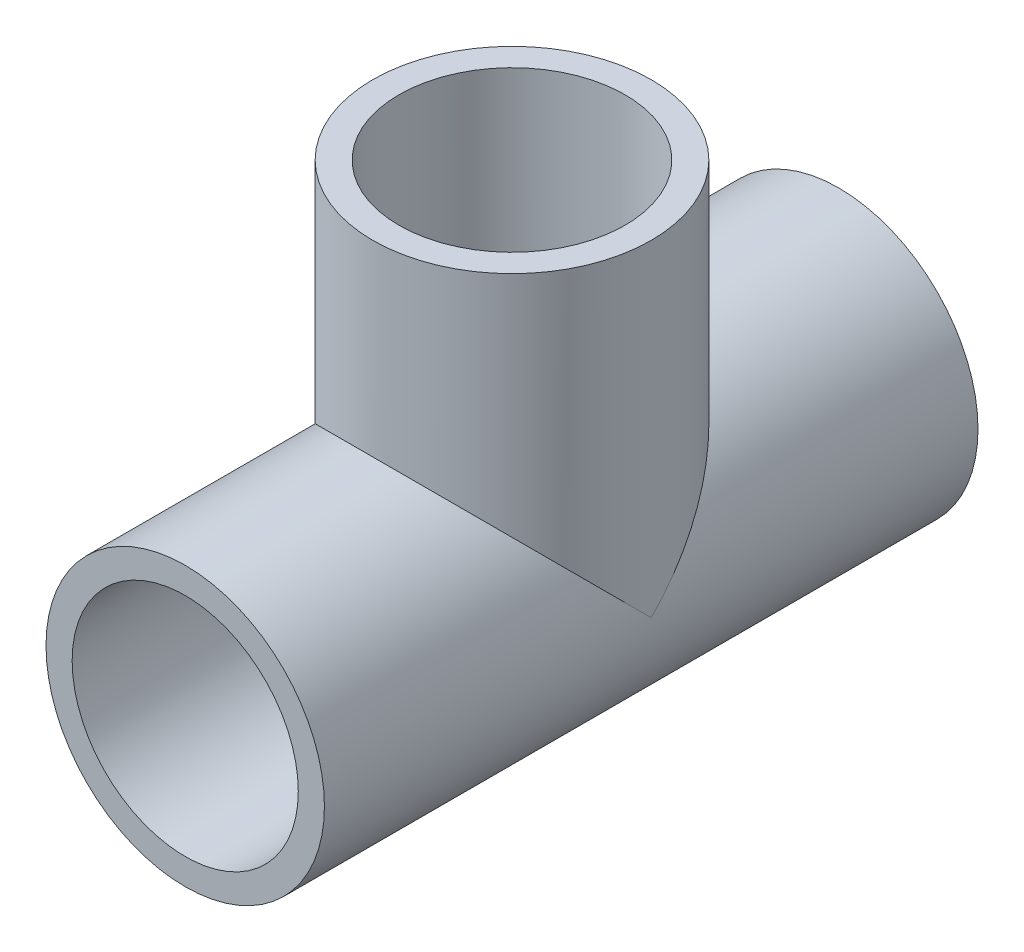
ISO-10303-21;
HEADER;
FILE_DESCRIPTION(('STEP AP214'),'2;1');
FILE_NAME('part.step','',(''),(''),'','','');
FILE_SCHEMA(('AUTOMOTIVE_DESIGN { 1 0 10303 214 1 1 1 1 }'));
ENDSEC;
DATA;
#1=APPLICATION_CONTEXT('core data for automotive mechanical design processes');
#2=APPLICATION_PROTOCOL_DEFINITION('international standard','automotive_design',2000,#1);
#3=PRODUCT_CONTEXT('',#1,'mechanical');
#4=PRODUCT('Part','Part','',(#3));
#5=PRODUCT_RELATED_PRODUCT_CATEGORY('part','',(#4));
#6=PRODUCT_DEFINITION_FORMATION('','',#4);
#7=PRODUCT_DEFINITION_CONTEXT('part definition',#1,'design');
#8=PRODUCT_DEFINITION('design','',#6,#7);
#9=PRODUCT_DEFINITION_SHAPE('','',#8);
#10=(LENGTH_UNIT() NAMED_UNIT(*) SI_UNIT(.MILLI.,.METRE.));
#11=(NAMED_UNIT(*) PLANE_ANGLE_UNIT() SI_UNIT($,.RADIAN.));
#12=(NAMED_UNIT(*) SI_UNIT($,.STERADIAN.) SOLID_ANGLE_UNIT());
#13=UNCERTAINTY_MEASURE_WITH_UNIT(LENGTH_MEASURE(1.E-05),#10,'distance_accuracy_value','');
#14=(GEOMETRIC_REPRESENTATION_CONTEXT(3) GLOBAL_UNCERTAINTY_ASSIGNED_CONTEXT((#13)) GLOBAL_UNIT_ASSIGNED_CONTEXT((#10,
#11,#12)) REPRESENTATION_CONTEXT('',''));
#15=CARTESIAN_POINT('',(0.,0.,0.));
#16=DIRECTION('',(0.,0.,1.));
#17=DIRECTION('',(1.,0.,0.));
#18=AXIS2_PLACEMENT_3D('',#15,#16,#17);
#19=CARTESIAN_POINT('',(0.,0.,-25.));
#20=DIRECTION('',(0.,0.,1.));
#21=DIRECTION('',(1.,0.,0.));
#22=AXIS2_PLACEMENT_3D('',#19,#20,#21);
#23=CYLINDRICAL_SURFACE('',#22,10.65);
#24=CARTESIAN_POINT('',(0.,0.,-25.));
#25=DIRECTION('',(0.,0.,1.));
#26=DIRECTION('',(1.,0.,0.));
#27=AXIS2_PLACEMENT_3D('',#24,#25,#26);
#28=CIRCLE('',#27,10.65);
#29=CARTESIAN_POINT('',(10.65,0.,-25.));
#30=VERTEX_POINT('',#29);
#31=EDGE_CURVE('E79',#30,#30,#28,.T.);
#32=ORIENTED_EDGE('',*,*,#31,.T.);
#33=EDGE_LOOP('',(#32));
#34=FACE_BOUND('',#33,.T.);
#35=CARTESIAN_POINT('',(0.,0.,25.));
#36=DIRECTION('',(0.,0.,1.));
#37=DIRECTION('',(1.,0.,0.));
#38=AXIS2_PLACEMENT_3D('',#35,#36,#37);
#39=CIRCLE('',#38,10.65);
#40=CARTESIAN_POINT('',(10.65,0.,25.));
#41=VERTEX_POINT('',#40);
#42=EDGE_CURVE('E66',#41,#41,#39,.T.);
#43=ORIENTED_EDGE('',*,*,#42,.F.);
#44=EDGE_LOOP('',(#43));
#45=FACE_BOUND('',#44,.T.);
#46=CARTESIAN_POINT('',(0.,0.,0.));
#47=DIRECTION('',(0.,0.707106781186547,0.707106781186547));
#48=DIRECTION('',(0.,-0.707106781186547,0.707106781186547));
#49=AXIS2_PLACEMENT_3D('',#46,#47,#48);
#50=ELLIPSE('',#49,15.0613744392735,10.65);
#51=CARTESIAN_POINT('',(-10.65,0.,0.));
#52=VERTEX_POINT('',#51);
#53=CARTESIAN_POINT('',(10.65,0.,0.));
#54=VERTEX_POINT('',#53);
#55=EDGE_CURVE('E40',#52,#54,#50,.F.);
#56=ORIENTED_EDGE('',*,*,#55,.T.);
#57=CARTESIAN_POINT('',(0.,0.,0.));
#58=DIRECTION('',(0.,-0.707106781186547,0.707106781186547));
#59=DIRECTION('',(0.,0.707106781186547,0.707106781186547));
#60=AXIS2_PLACEMENT_3D('',#57,#58,#59);
#61=ELLIPSE('',#60,15.0613744392735,10.65);
#62=EDGE_CURVE('E11',#54,#52,#61,.T.);
#63=ORIENTED_EDGE('',*,*,#62,.T.);
#64=EDGE_LOOP('',(#56,#63));
#65=FACE_BOUND('',#64,.T.);
#66=ADVANCED_FACE('F33',(#34,#45,#65),#23,.T.);
#67=CARTESIAN_POINT('',(0.,0.,-25.));
#68=DIRECTION('',(0.,0.,1.));
#69=DIRECTION('',(1.,0.,0.));
#70=AXIS2_PLACEMENT_3D('',#67,#68,#69);
#71=PLANE('',#70);
#72=CARTESIAN_POINT('',(0.,0.,-25.));
#73=DIRECTION('',(0.,0.,1.));
#74=DIRECTION('',(1.,0.,0.));
#75=AXIS2_PLACEMENT_3D('',#72,#73,#74);
#76=CIRCLE('',#75,8.65);
#77=CARTESIAN_POINT('',(8.65,0.,-25.));
#78=VERTEX_POINT('',#77);
#79=EDGE_CURVE('E59',#78,#78,#76,.T.);
#80=ORIENTED_EDGE('',*,*,#79,.T.);
#81=EDGE_LOOP('',(#80));
#82=FACE_BOUND('',#81,.T.);
#83=ORIENTED_EDGE('',*,*,#31,.F.);
#84=EDGE_LOOP('',(#83));
#85=FACE_BOUND('',#84,.T.);
#86=ADVANCED_FACE('F83',(#82,#85),#71,.F.);
#87=CARTESIAN_POINT('',(0.,0.,25.));
#88=DIRECTION('',(0.,0.,-1.));
#89=DIRECTION('',(1.,0.,0.));
#90=AXIS2_PLACEMENT_3D('',#87,#88,#89);
#91=PLANE('',#90);
#92=CARTESIAN_POINT('',(0.,0.,25.));
#93=DIRECTION('',(0.,0.,-1.));
#94=DIRECTION('',(-1.,0.,0.));
#95=AXIS2_PLACEMENT_3D('',#92,#93,#94);
#96=CIRCLE('',#95,8.65);
#97=CARTESIAN_POINT('',(-8.65,0.,25.));
#98=VERTEX_POINT('',#97);
#99=EDGE_CURVE('E71',#98,#98,#96,.F.);
#100=ORIENTED_EDGE('',*,*,#99,.F.);
#101=EDGE_LOOP('',(#100));
#102=FACE_BOUND('',#101,.T.);
#103=ORIENTED_EDGE('',*,*,#42,.T.);
#104=EDGE_LOOP('',(#103));
#105=FACE_BOUND('',#104,.T.);
#106=ADVANCED_FACE('F88',(#102,#105),#91,.F.);
#107=CARTESIAN_POINT('',(0.,25.,0.));
#108=DIRECTION('',(0.,-1.,0.));
#109=DIRECTION('',(0.,0.,-1.));
#110=AXIS2_PLACEMENT_3D('',#107,#108,#109);
#111=CYLINDRICAL_SURFACE('',#110,10.65);
#112=ORIENTED_EDGE('',*,*,#62,.F.);
#113=ORIENTED_EDGE('',*,*,#55,.F.);
#114=EDGE_LOOP('',(#112,#113));
#115=FACE_BOUND('',#114,.T.);
#116=CARTESIAN_POINT('',(0.,25.,0.));
#117=DIRECTION('',(0.,1.,0.));
#118=DIRECTION('',(0.,0.,1.));
#119=AXIS2_PLACEMENT_3D('',#116,#117,#118);
#120=CIRCLE('',#119,10.65);
#121=CARTESIAN_POINT('',(0.,25.,10.65));
#122=VERTEX_POINT('',#121);
#123=EDGE_CURVE('E63',#122,#122,#120,.T.);
#124=ORIENTED_EDGE('',*,*,#123,.F.);
#125=EDGE_LOOP('',(#124));
#126=FACE_BOUND('',#125,.T.);
#127=ADVANCED_FACE('F95',(#115,#126),#111,.T.);
#128=CARTESIAN_POINT('',(0.,25.,0.));
#129=DIRECTION('',(0.,1.,0.));
#130=DIRECTION('',(0.,0.,1.));
#131=AXIS2_PLACEMENT_3D('',#128,#129,#130);
#132=PLANE('',#131);
#133=CARTESIAN_POINT('',(0.,25.,0.));
#134=DIRECTION('',(0.,1.,0.));
#135=DIRECTION('',(0.,0.,1.));
#136=AXIS2_PLACEMENT_3D('',#133,#134,#135);
#137=CIRCLE('',#136,8.65);
#138=CARTESIAN_POINT('',(0.,25.,8.65));
#139=VERTEX_POINT('',#138);
#140=EDGE_CURVE('E74',#139,#139,#137,.T.);
#141=ORIENTED_EDGE('',*,*,#140,.F.);
#142=EDGE_LOOP('',(#141));
#143=FACE_BOUND('',#142,.T.);
#144=ORIENTED_EDGE('',*,*,#123,.T.);
#145=EDGE_LOOP('',(#144));
#146=FACE_BOUND('',#145,.T.);
#147=ADVANCED_FACE('F101',(#143,#146),#132,.T.);
#148=CARTESIAN_POINT('',(0.,0.,-25.));
#149=DIRECTION('',(0.,0.,1.));
#150=DIRECTION('',(1.,0.,0.));
#151=AXIS2_PLACEMENT_3D('',#148,#149,#150);
#152=CYLINDRICAL_SURFACE('',#151,8.65);
#153=ORIENTED_EDGE('',*,*,#79,.F.);
#154=EDGE_LOOP('',(#153));
#155=FACE_BOUND('',#154,.T.);
#156=ORIENTED_EDGE('',*,*,#99,.T.);
#157=EDGE_LOOP('',(#156));
#158=FACE_BOUND('',#157,.T.);
#159=CARTESIAN_POINT('',(0.,0.,0.));
#160=DIRECTION('',(0.,0.707106781186547,0.707106781186547));
#161=DIRECTION('',(0.,-0.707106781186547,0.707106781186547));
#162=AXIS2_PLACEMENT_3D('',#159,#160,#161);
#163=ELLIPSE('',#162,12.2329473145273,8.65);
#164=CARTESIAN_POINT('',(-8.65,0.,0.));
#165=VERTEX_POINT('',#164);
#166=CARTESIAN_POINT('',(8.65,0.,0.));
#167=VERTEX_POINT('',#166);
#168=EDGE_CURVE('E54',#165,#167,#163,.F.);
#169=ORIENTED_EDGE('',*,*,#168,.F.);
#170=CARTESIAN_POINT('',(0.,0.,0.));
#171=DIRECTION('',(0.,-0.707106781186547,0.707106781186547));
#172=DIRECTION('',(0.,0.707106781186547,0.707106781186547));
#173=AXIS2_PLACEMENT_3D('',#170,#171,#172);
#174=ELLIPSE('',#173,12.2329473145273,8.65);
#175=EDGE_CURVE('E57',#167,#165,#174,.T.);
#176=ORIENTED_EDGE('',*,*,#175,.F.);
#177=EDGE_LOOP('',(#169,#176));
#178=FACE_BOUND('',#177,.T.);
#179=ADVANCED_FACE('F56',(#155,#158,#178),#152,.F.);
#180=CARTESIAN_POINT('',(0.,25.,0.));
#181=DIRECTION('',(0.,-1.,0.));
#182=DIRECTION('',(0.,0.,-1.));
#183=AXIS2_PLACEMENT_3D('',#180,#181,#182);
#184=CYLINDRICAL_SURFACE('',#183,8.65);
#185=ORIENTED_EDGE('',*,*,#175,.T.);
#186=ORIENTED_EDGE('',*,*,#168,.T.);
#187=EDGE_LOOP('',(#185,#186));
#188=FACE_BOUND('',#187,.T.);
#189=ORIENTED_EDGE('',*,*,#140,.T.);
#190=EDGE_LOOP('',(#189));
#191=FACE_BOUND('',#190,.T.);
#192=ADVANCED_FACE('F61',(#188,#191),#184,.F.);
#193=CLOSED_SHELL('',(#66,#86,#106,#127,#147,#179,#192));
#194=MANIFOLD_SOLID_BREP('B2',#193);
#195=ADVANCED_BREP_SHAPE_REPRESENTATION('',(#18,#194),#14);
#196=SHAPE_DEFINITION_REPRESENTATION(#9,#195);
ENDSEC;
END-ISO-10303-21;
